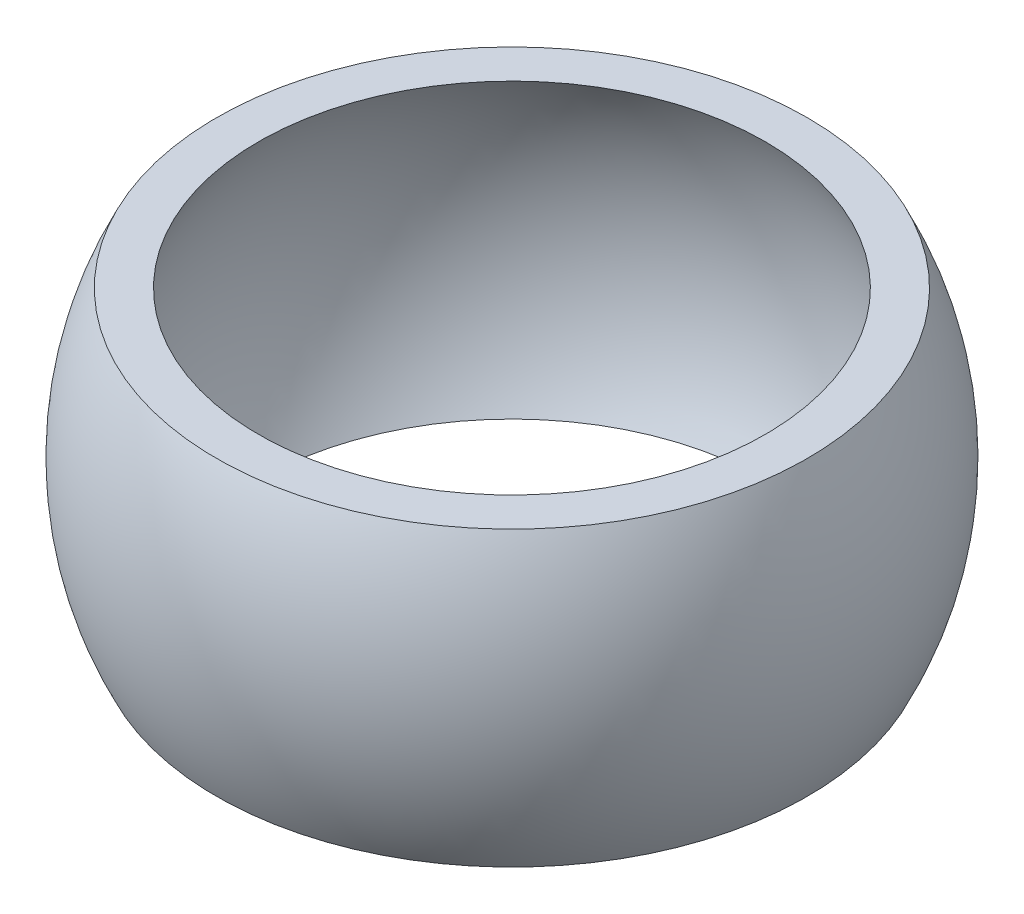
ISO-10303-21;
HEADER;
FILE_DESCRIPTION(('STEP AP214'),'2;1');
FILE_NAME('part.step','',(''),(''),'','','');
FILE_SCHEMA(('AUTOMOTIVE_DESIGN { 1 0 10303 214 1 1 1 1 }'));
ENDSEC;
DATA;
#1=APPLICATION_CONTEXT('core data for automotive mechanical design processes');
#2=APPLICATION_PROTOCOL_DEFINITION('international standard','automotive_design',2000,#1);
#3=PRODUCT_CONTEXT('',#1,'mechanical');
#4=PRODUCT('Part','Part','',(#3));
#5=PRODUCT_RELATED_PRODUCT_CATEGORY('part','',(#4));
#6=PRODUCT_DEFINITION_FORMATION('','',#4);
#7=PRODUCT_DEFINITION_CONTEXT('part definition',#1,'design');
#8=PRODUCT_DEFINITION('design','',#6,#7);
#9=PRODUCT_DEFINITION_SHAPE('','',#8);
#10=(LENGTH_UNIT() NAMED_UNIT(*) SI_UNIT(.MILLI.,.METRE.));
#11=(NAMED_UNIT(*) PLANE_ANGLE_UNIT() SI_UNIT($,.RADIAN.));
#12=(NAMED_UNIT(*) SI_UNIT($,.STERADIAN.) SOLID_ANGLE_UNIT());
#13=UNCERTAINTY_MEASURE_WITH_UNIT(LENGTH_MEASURE(1.E-05),#10,'distance_accuracy_value','');
#14=(GEOMETRIC_REPRESENTATION_CONTEXT(3) GLOBAL_UNCERTAINTY_ASSIGNED_CONTEXT((#13)) GLOBAL_UNIT_ASSIGNED_CONTEXT((#10,
#11,#12)) REPRESENTATION_CONTEXT('',''));
#15=CARTESIAN_POINT('',(0.,0.,0.));
#16=DIRECTION('',(0.,0.,1.));
#17=DIRECTION('',(1.,0.,0.));
#18=AXIS2_PLACEMENT_3D('',#15,#16,#17);
#19=CARTESIAN_POINT('',(0.,0.,0.));
#20=DIRECTION('',(0.,-1.,0.));
#21=DIRECTION('',(1.,0.,0.));
#22=AXIS2_PLACEMENT_3D('',#19,#20,#21);
#23=SPHERICAL_SURFACE('',#22,14.);
#24=CARTESIAN_POINT('',(0.,-7.,0.));
#25=DIRECTION('',(0.,-1.,0.));
#26=DIRECTION('',(0.,0.,-1.));
#27=AXIS2_PLACEMENT_3D('',#24,#25,#26);
#28=CIRCLE('',#27,12.1243556529821);
#29=CARTESIAN_POINT('',(0.,-7.,-12.1243556529821));
#30=VERTEX_POINT('',#29);
#31=EDGE_CURVE('E44',#30,#30,#28,.T.);
#32=ORIENTED_EDGE('',*,*,#31,.T.);
#33=EDGE_LOOP('',(#32));
#34=FACE_BOUND('',#33,.T.);
#35=CARTESIAN_POINT('',(0.,7.,0.));
#36=DIRECTION('',(0.,-1.,0.));
#37=DIRECTION('',(0.,0.,-1.));
#38=AXIS2_PLACEMENT_3D('',#35,#36,#37);
#39=CIRCLE('',#38,12.1243556529821);
#40=CARTESIAN_POINT('',(0.,7.,-12.1243556529821));
#41=VERTEX_POINT('',#40);
#42=EDGE_CURVE('E10',#41,#41,#39,.T.);
#43=ORIENTED_EDGE('',*,*,#42,.F.);
#44=EDGE_LOOP('',(#43));
#45=FACE_BOUND('',#44,.T.);
#46=ADVANCED_FACE('F30',(#34,#45),#23,.F.);
#47=CARTESIAN_POINT('',(12.1243556529821,7.,0.));
#48=DIRECTION('',(0.,1.,0.));
#49=DIRECTION('',(0.,0.,1.));
#50=AXIS2_PLACEMENT_3D('',#47,#48,#49);
#51=PLANE('',#50);
#52=ORIENTED_EDGE('',*,*,#42,.T.);
#53=EDGE_LOOP('',(#52));
#54=FACE_BOUND('',#53,.T.);
#55=CARTESIAN_POINT('',(0.,7.,0.));
#56=DIRECTION('',(0.,-1.,0.));
#57=DIRECTION('',(0.,0.,-1.));
#58=AXIS2_PLACEMENT_3D('',#55,#56,#57);
#59=CIRCLE('',#58,14.1243556529821);
#60=CARTESIAN_POINT('',(0.,7.,-14.1243556529821));
#61=VERTEX_POINT('',#60);
#62=EDGE_CURVE('E36',#61,#61,#59,.T.);
#63=ORIENTED_EDGE('',*,*,#62,.F.);
#64=EDGE_LOOP('',(#63));
#65=FACE_BOUND('',#64,.T.);
#66=ADVANCED_FACE('F60',(#54,#65),#51,.T.);
#67=CARTESIAN_POINT('',(0.,0.,0.));
#68=DIRECTION('',(0.,-1.,0.));
#69=DIRECTION('',(1.,0.,0.));
#70=AXIS2_PLACEMENT_3D('',#67,#68,#69);
#71=SPHERICAL_SURFACE('',#70,15.7638010204369);
#72=ORIENTED_EDGE('',*,*,#62,.T.);
#73=EDGE_LOOP('',(#72));
#74=FACE_BOUND('',#73,.T.);
#75=CARTESIAN_POINT('',(0.,-7.,0.));
#76=DIRECTION('',(0.,-1.,0.));
#77=DIRECTION('',(0.,0.,-1.));
#78=AXIS2_PLACEMENT_3D('',#75,#76,#77);
#79=CIRCLE('',#78,14.1243556529821);
#80=CARTESIAN_POINT('',(0.,-7.,-14.1243556529821));
#81=VERTEX_POINT('',#80);
#82=EDGE_CURVE('E40',#81,#81,#79,.T.);
#83=ORIENTED_EDGE('',*,*,#82,.F.);
#84=EDGE_LOOP('',(#83));
#85=FACE_BOUND('',#84,.T.);
#86=ADVANCED_FACE('F54',(#74,#85),#71,.T.);
#87=CARTESIAN_POINT('',(12.1243556529821,-7.,0.));
#88=DIRECTION('',(0.,-1.,0.));
#89=DIRECTION('',(0.,0.,-1.));
#90=AXIS2_PLACEMENT_3D('',#87,#88,#89);
#91=PLANE('',#90);
#92=ORIENTED_EDGE('',*,*,#82,.T.);
#93=EDGE_LOOP('',(#92));
#94=FACE_BOUND('',#93,.T.);
#95=ORIENTED_EDGE('',*,*,#31,.F.);
#96=EDGE_LOOP('',(#95));
#97=FACE_BOUND('',#96,.T.);
#98=ADVANCED_FACE('F52',(#94,#97),#91,.T.);
#99=CLOSED_SHELL('',(#46,#66,#86,#98));
#100=MANIFOLD_SOLID_BREP('B2',#99);
#101=ADVANCED_BREP_SHAPE_REPRESENTATION('',(#18,#100),#14);
#102=SHAPE_DEFINITION_REPRESENTATION(#9,#101);
ENDSEC;
END-ISO-10303-21;
